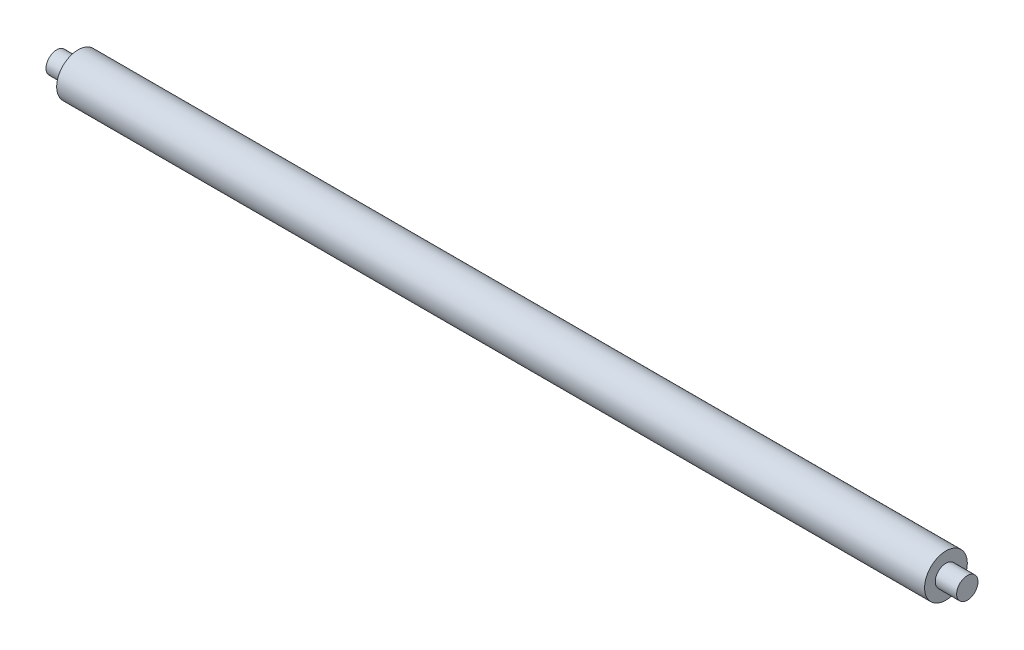
ISO-10303-21;
HEADER;
FILE_DESCRIPTION(('STEP AP214'),'2;1');
FILE_NAME('part.step','',(''),(''),'','','');
FILE_SCHEMA(('AUTOMOTIVE_DESIGN { 1 0 10303 214 1 1 1 1 }'));
ENDSEC;
DATA;
#1=APPLICATION_CONTEXT('core data for automotive mechanical design processes');
#2=APPLICATION_PROTOCOL_DEFINITION('international standard','automotive_design',2000,#1);
#3=PRODUCT_CONTEXT('',#1,'mechanical');
#4=PRODUCT('Part','Part','',(#3));
#5=PRODUCT_RELATED_PRODUCT_CATEGORY('part','',(#4));
#6=PRODUCT_DEFINITION_FORMATION('','',#4);
#7=PRODUCT_DEFINITION_CONTEXT('part definition',#1,'design');
#8=PRODUCT_DEFINITION('design','',#6,#7);
#9=PRODUCT_DEFINITION_SHAPE('','',#8);
#10=(LENGTH_UNIT() NAMED_UNIT(*) SI_UNIT(.MILLI.,.METRE.));
#11=(NAMED_UNIT(*) PLANE_ANGLE_UNIT() SI_UNIT($,.RADIAN.));
#12=(NAMED_UNIT(*) SI_UNIT($,.STERADIAN.) SOLID_ANGLE_UNIT());
#13=UNCERTAINTY_MEASURE_WITH_UNIT(LENGTH_MEASURE(1.E-05),#10,'distance_accuracy_value','');
#14=(GEOMETRIC_REPRESENTATION_CONTEXT(3) GLOBAL_UNCERTAINTY_ASSIGNED_CONTEXT((#13)) GLOBAL_UNIT_ASSIGNED_CONTEXT((#10,
#11,#12)) REPRESENTATION_CONTEXT('',''));
#15=CARTESIAN_POINT('',(0.,0.,0.));
#16=DIRECTION('',(0.,0.,1.));
#17=DIRECTION('',(1.,0.,0.));
#18=AXIS2_PLACEMENT_3D('',#15,#16,#17);
#19=CARTESIAN_POINT('',(101.5,0.,0.));
#20=DIRECTION('',(-1.,0.,0.));
#21=DIRECTION('',(0.,0.,1.));
#22=AXIS2_PLACEMENT_3D('',#19,#20,#21);
#23=CYLINDRICAL_SURFACE('',#22,5.);
#24=CARTESIAN_POINT('',(101.5,0.,0.));
#25=DIRECTION('',(1.,0.,0.));
#26=DIRECTION('',(0.,0.,-1.));
#27=AXIS2_PLACEMENT_3D('',#24,#25,#26);
#28=CIRCLE('',#27,5.);
#29=CARTESIAN_POINT('',(101.5,0.,-5.));
#30=VERTEX_POINT('',#29);
#31=EDGE_CURVE('E37',#30,#30,#28,.T.);
#32=ORIENTED_EDGE('',*,*,#31,.F.);
#33=EDGE_LOOP('',(#32));
#34=FACE_BOUND('',#33,.T.);
#35=CARTESIAN_POINT('',(-101.5,0.,0.));
#36=DIRECTION('',(1.,0.,0.));
#37=DIRECTION('',(0.,0.,-1.));
#38=AXIS2_PLACEMENT_3D('',#35,#36,#37);
#39=CIRCLE('',#38,5.);
#40=CARTESIAN_POINT('',(-101.5,0.,-5.));
#41=VERTEX_POINT('',#40);
#42=EDGE_CURVE('E41',#41,#41,#39,.T.);
#43=ORIENTED_EDGE('',*,*,#42,.T.);
#44=EDGE_LOOP('',(#43));
#45=FACE_BOUND('',#44,.T.);
#46=ADVANCED_FACE('F31',(#34,#45),#23,.T.);
#47=CARTESIAN_POINT('',(101.5,0.,0.));
#48=DIRECTION('',(1.,0.,0.));
#49=DIRECTION('',(0.,0.,-1.));
#50=AXIS2_PLACEMENT_3D('',#47,#48,#49);
#51=PLANE('',#50);
#52=CARTESIAN_POINT('',(101.5,0.,0.));
#53=DIRECTION('',(1.,0.,0.));
#54=DIRECTION('',(0.,0.,-1.));
#55=AXIS2_PLACEMENT_3D('',#52,#53,#54);
#56=CIRCLE('',#55,2.5);
#57=CARTESIAN_POINT('',(101.5,0.,-2.5));
#58=VERTEX_POINT('',#57);
#59=EDGE_CURVE('E46',#58,#58,#56,.F.);
#60=ORIENTED_EDGE('',*,*,#59,.T.);
#61=EDGE_LOOP('',(#60));
#62=FACE_BOUND('',#61,.T.);
#63=ORIENTED_EDGE('',*,*,#31,.T.);
#64=EDGE_LOOP('',(#63));
#65=FACE_BOUND('',#64,.T.);
#66=ADVANCED_FACE('F75',(#62,#65),#51,.T.);
#67=CARTESIAN_POINT('',(-101.5,0.,0.));
#68=DIRECTION('',(1.,0.,0.));
#69=DIRECTION('',(0.,0.,-1.));
#70=AXIS2_PLACEMENT_3D('',#67,#68,#69);
#71=PLANE('',#70);
#72=CARTESIAN_POINT('',(-101.5,0.,0.));
#73=DIRECTION('',(1.,0.,0.));
#74=DIRECTION('',(0.,0.,-1.));
#75=AXIS2_PLACEMENT_3D('',#72,#73,#74);
#76=CIRCLE('',#75,2.5);
#77=CARTESIAN_POINT('',(-101.5,0.,-2.5));
#78=VERTEX_POINT('',#77);
#79=EDGE_CURVE('E10',#78,#78,#76,.F.);
#80=ORIENTED_EDGE('',*,*,#79,.F.);
#81=EDGE_LOOP('',(#80));
#82=FACE_BOUND('',#81,.T.);
#83=ORIENTED_EDGE('',*,*,#42,.F.);
#84=EDGE_LOOP('',(#83));
#85=FACE_BOUND('',#84,.T.);
#86=ADVANCED_FACE('F80',(#82,#85),#71,.F.);
#87=CARTESIAN_POINT('',(-106.5,0.,0.));
#88=DIRECTION('',(1.,0.,0.));
#89=DIRECTION('',(0.,0.,-1.));
#90=AXIS2_PLACEMENT_3D('',#87,#88,#89);
#91=PLANE('',#90);
#92=CARTESIAN_POINT('',(-106.5,0.,0.));
#93=DIRECTION('',(1.,0.,0.));
#94=DIRECTION('',(0.,0.,-1.));
#95=AXIS2_PLACEMENT_3D('',#92,#93,#94);
#96=CIRCLE('',#95,2.5);
#97=CARTESIAN_POINT('',(-106.5,0.,-2.5));
#98=VERTEX_POINT('',#97);
#99=EDGE_CURVE('E51',#98,#98,#96,.T.);
#100=ORIENTED_EDGE('',*,*,#99,.F.);
#101=EDGE_LOOP('',(#100));
#102=FACE_BOUND('',#101,.T.);
#103=ADVANCED_FACE('F69',(#102),#91,.F.);
#104=CARTESIAN_POINT('',(106.5,0.,0.));
#105=DIRECTION('',(-1.,0.,0.));
#106=DIRECTION('',(0.,0.,1.));
#107=AXIS2_PLACEMENT_3D('',#104,#105,#106);
#108=CYLINDRICAL_SURFACE('',#107,2.5);
#109=ORIENTED_EDGE('',*,*,#99,.T.);
#110=EDGE_LOOP('',(#109));
#111=FACE_BOUND('',#110,.T.);
#112=ORIENTED_EDGE('',*,*,#79,.T.);
#113=EDGE_LOOP('',(#112));
#114=FACE_BOUND('',#113,.T.);
#115=ADVANCED_FACE('F61',(#111,#114),#108,.T.);
#116=ORIENTED_EDGE('',*,*,#59,.F.);
#117=EDGE_LOOP('',(#116));
#118=FACE_BOUND('',#117,.T.);
#119=CARTESIAN_POINT('',(106.5,0.,0.));
#120=DIRECTION('',(1.,0.,0.));
#121=DIRECTION('',(0.,0.,-1.));
#122=AXIS2_PLACEMENT_3D('',#119,#120,#121);
#123=CIRCLE('',#122,2.5);
#124=CARTESIAN_POINT('',(106.5,0.,-2.5));
#125=VERTEX_POINT('',#124);
#126=EDGE_CURVE('E50',#125,#125,#123,.T.);
#127=ORIENTED_EDGE('',*,*,#126,.F.);
#128=EDGE_LOOP('',(#127));
#129=FACE_BOUND('',#128,.T.);
#130=ADVANCED_FACE('F59',(#118,#129),#108,.T.);
#131=CARTESIAN_POINT('',(106.5,0.,0.));
#132=DIRECTION('',(1.,0.,0.));
#133=DIRECTION('',(0.,0.,-1.));
#134=AXIS2_PLACEMENT_3D('',#131,#132,#133);
#135=PLANE('',#134);
#136=ORIENTED_EDGE('',*,*,#126,.T.);
#137=EDGE_LOOP('',(#136));
#138=FACE_BOUND('',#137,.T.);
#139=ADVANCED_FACE('F57',(#138),#135,.T.);
#140=CLOSED_SHELL('',(#46,#66,#86,#103,#115,#130,#139));
#141=MANIFOLD_SOLID_BREP('B2',#140);
#142=ADVANCED_BREP_SHAPE_REPRESENTATION('',(#18,#141),#14);
#143=SHAPE_DEFINITION_REPRESENTATION(#9,#142);
ENDSEC;
END-ISO-10303-21;
